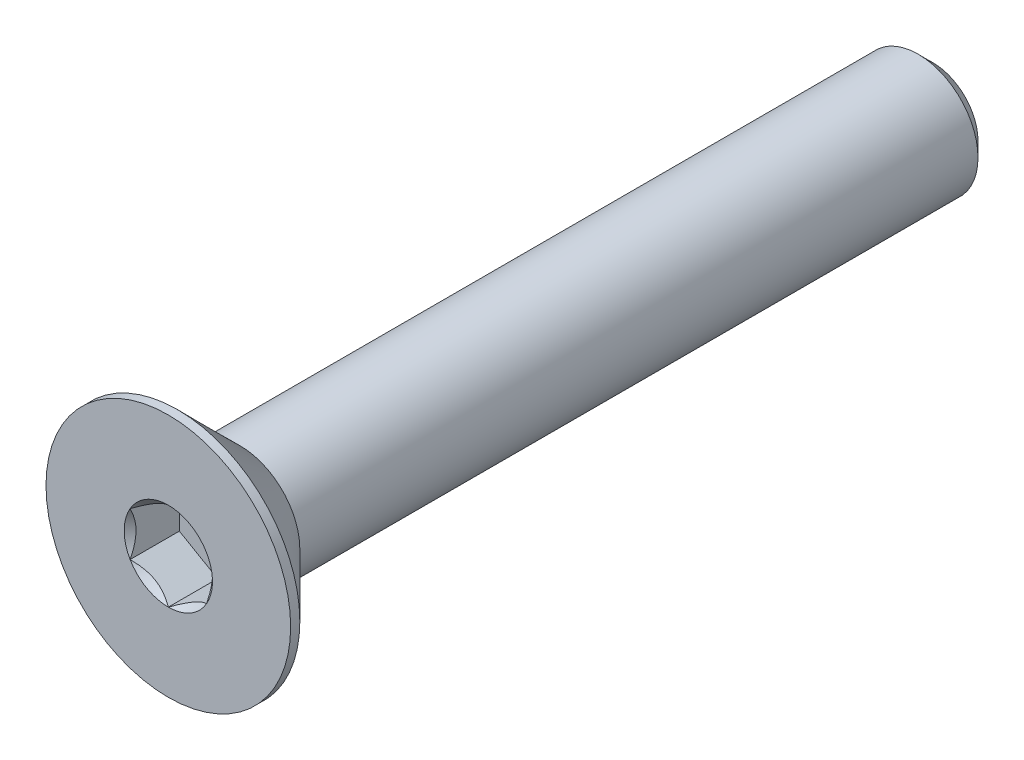
ISO-10303-21;
HEADER;
FILE_DESCRIPTION(('STEP AP214'),'2;1');
FILE_NAME('part.step','',(''),(''),'','','');
FILE_SCHEMA(('AUTOMOTIVE_DESIGN { 1 0 10303 214 1 1 1 1 }'));
ENDSEC;
DATA;
#1=APPLICATION_CONTEXT('core data for automotive mechanical design processes');
#2=APPLICATION_PROTOCOL_DEFINITION('international standard','automotive_design',2000,#1);
#3=PRODUCT_CONTEXT('',#1,'mechanical');
#4=PRODUCT('Part','Part','',(#3));
#5=PRODUCT_RELATED_PRODUCT_CATEGORY('part','',(#4));
#6=PRODUCT_DEFINITION_FORMATION('','',#4);
#7=PRODUCT_DEFINITION_CONTEXT('part definition',#1,'design');
#8=PRODUCT_DEFINITION('design','',#6,#7);
#9=PRODUCT_DEFINITION_SHAPE('','',#8);
#10=(LENGTH_UNIT() NAMED_UNIT(*) SI_UNIT(.MILLI.,.METRE.));
#11=(NAMED_UNIT(*) PLANE_ANGLE_UNIT() SI_UNIT($,.RADIAN.));
#12=(NAMED_UNIT(*) SI_UNIT($,.STERADIAN.) SOLID_ANGLE_UNIT());
#13=UNCERTAINTY_MEASURE_WITH_UNIT(LENGTH_MEASURE(1.E-05),#10,'distance_accuracy_value','');
#14=(GEOMETRIC_REPRESENTATION_CONTEXT(3) GLOBAL_UNCERTAINTY_ASSIGNED_CONTEXT((#13)) GLOBAL_UNIT_ASSIGNED_CONTEXT((#10,
#11,#12)) REPRESENTATION_CONTEXT('',''));
#15=CARTESIAN_POINT('',(0.,0.,0.));
#16=DIRECTION('',(0.,0.,1.));
#17=DIRECTION('',(1.,0.,0.));
#18=AXIS2_PLACEMENT_3D('',#15,#16,#17);
#19=CARTESIAN_POINT('',(1.25,-0.721687836487033,-1.61));
#20=DIRECTION('',(0.,0.,1.));
#21=DIRECTION('',(1.,0.,0.));
#22=AXIS2_PLACEMENT_3D('',#19,#20,#21);
#23=PLANE('',#22);
#24=DIRECTION('',(0.,-1.,0.));
#25=VECTOR('',#24,1.);
#26=CARTESIAN_POINT('',(-1.25,0.721687836487033,-1.61));
#27=LINE('',#26,#25);
#28=CARTESIAN_POINT('',(-1.25,0.721687836487032,-1.61));
#29=VERTEX_POINT('',#28);
#30=CARTESIAN_POINT('',(-1.25,-0.721687836487033,-1.61));
#31=VERTEX_POINT('',#30);
#32=EDGE_CURVE('E83',#29,#31,#27,.T.);
#33=ORIENTED_EDGE('',*,*,#32,.T.);
#34=DIRECTION('',(0.866025403784439,-0.5,0.));
#35=VECTOR('',#34,1.);
#36=CARTESIAN_POINT('',(-1.25,-0.721687836487033,-1.61));
#37=LINE('',#36,#35);
#38=CARTESIAN_POINT('',(0.,-1.44337567297406,-1.61));
#39=VERTEX_POINT('',#38);
#40=EDGE_CURVE('E85',#31,#39,#37,.T.);
#41=ORIENTED_EDGE('',*,*,#40,.T.);
#42=DIRECTION('',(0.866025403784439,0.5,0.));
#43=VECTOR('',#42,1.);
#44=CARTESIAN_POINT('',(0.,-1.44337567297406,-1.61));
#45=LINE('',#44,#43);
#46=CARTESIAN_POINT('',(1.25,-0.721687836487033,-1.61));
#47=VERTEX_POINT('',#46);
#48=EDGE_CURVE('E86',#39,#47,#45,.T.);
#49=ORIENTED_EDGE('',*,*,#48,.T.);
#50=DIRECTION('',(0.,1.,0.));
#51=VECTOR('',#50,1.);
#52=CARTESIAN_POINT('',(1.25,-0.721687836487033,-1.61));
#53=LINE('',#52,#51);
#54=CARTESIAN_POINT('',(1.25,0.721687836487033,-1.61));
#55=VERTEX_POINT('',#54);
#56=EDGE_CURVE('E72',#47,#55,#53,.T.);
#57=ORIENTED_EDGE('',*,*,#56,.T.);
#58=DIRECTION('',(-0.866025403784439,0.5,0.));
#59=VECTOR('',#58,1.);
#60=CARTESIAN_POINT('',(1.25,0.721687836487033,-1.61));
#61=LINE('',#60,#59);
#62=CARTESIAN_POINT('',(0.,1.44337567297406,-1.61));
#63=VERTEX_POINT('',#62);
#64=EDGE_CURVE('E111',#55,#63,#61,.T.);
#65=ORIENTED_EDGE('',*,*,#64,.T.);
#66=DIRECTION('',(-0.866025403784439,-0.5,0.));
#67=VECTOR('',#66,1.);
#68=CARTESIAN_POINT('',(0.,1.44337567297406,-1.61));
#69=LINE('',#68,#67);
#70=EDGE_CURVE('E116',#63,#29,#69,.T.);
#71=ORIENTED_EDGE('',*,*,#70,.T.);
#72=EDGE_LOOP('',(#33,#41,#49,#57,#65,#71));
#73=FACE_BOUND('',#72,.T.);
#74=ADVANCED_FACE('F17',(#73),#23,.T.);
#75=CARTESIAN_POINT('',(0.,-1.44337567297406,-1.61));
#76=DIRECTION('',(0.5,-0.866025403784439,0.));
#77=DIRECTION('',(0.866025403784439,0.5,0.));
#78=AXIS2_PLACEMENT_3D('',#75,#76,#77);
#79=PLANE('',#78);
#80=CARTESIAN_POINT('',(-1.59647601274641E-12,-1.44337567297499,-2.2682928164299E-12));
#81=CARTESIAN_POINT('',(0.0429631084916683,-1.41857091072118,-0.024780960285326));
#82=CARTESIAN_POINT('',(0.0866445640224961,-1.39335141061186,-0.0481062505422108));
#83=CARTESIAN_POINT('',(0.175715534518587,-1.34192626181896,-0.0908138610995846));
#84=CARTESIAN_POINT('',(0.221113515509129,-1.3157157252734,-0.110172426663462));
#85=CARTESIAN_POINT('',(0.312656311401012,-1.26286346742285,-0.143333784117164));
#86=CARTESIAN_POINT('',(0.358777825771211,-1.23623519868579,-0.15721990325138));
#87=CARTESIAN_POINT('',(0.45203596100152,-1.18239258920645,-0.178614098245694));
#88=CARTESIAN_POINT('',(0.499169734949581,-1.15517989212961,-0.186138138130082));
#89=CARTESIAN_POINT('',(0.580409086338886,-1.1082763307362,-0.192927172266352));
#90=CARTESIAN_POINT('',(0.6144098218632,-1.0886459969286,-0.19393181141306));
#91=CARTESIAN_POINT('',(0.682351445146423,-1.04941988243685,-0.192236504858619));
#92=CARTESIAN_POINT('',(0.716292318027036,-1.02982411034269,-0.189535740825175));
#93=CARTESIAN_POINT('',(0.783846380048844,-0.99082175444955,-0.180585751756811));
#94=CARTESIAN_POINT('',(0.817459234875116,-0.97141536366737,-0.174333227052609));
#95=CARTESIAN_POINT('',(0.884123738991267,-0.932926594270518,-0.158616460881214));
#96=CARTESIAN_POINT('',(0.917175141068938,-0.91384435838388,-0.149150841277128));
#97=CARTESIAN_POINT('',(1.00178642984031,-0.864994008035247,-0.121071668556236));
#98=CARTESIAN_POINT('',(1.05281387539248,-0.835533298609642,-0.100350655055702));
#99=CARTESIAN_POINT('',(1.15287239429478,-0.777764485786684,-0.0536764942537952));
#100=CARTESIAN_POINT('',(1.20190935742265,-0.749452981924566,-0.0277403788128117));
#101=CARTESIAN_POINT('',(1.25000000000159,-0.721687836486111,-2.26875042830836E-12));
#102=B_SPLINE_CURVE_WITH_KNOTS('',3,(#80,#81,#82,#83,#84,#85,#86,#87,#88,#89,#90,#91,#92,#93,
#94,#95,#96,#97,#98,#99,#100,#101),.UNSPECIFIED.,.F.,.F.,(4,2,2,2,2,2,2,2,2,2,4),(0.,
0.166478683193945,0.333926926769032,0.498716658424014,0.663091654503518,0.780745575390527,
0.89842548413854,1.01621489951224,1.13405490022132,1.3211159162831,1.5075756576265),.UNSPECIFIED.);
#103=CARTESIAN_POINT('',(0.,-1.44337567297566,-1.59483068508603E-12));
#104=VERTEX_POINT('',#103);
#105=CARTESIAN_POINT('',(1.2500000000008,-0.721687836489763,-1.13439250920524E-12));
#106=VERTEX_POINT('',#105);
#107=EDGE_CURVE('E20',#104,#106,#102,.T.);
#108=ORIENTED_EDGE('',*,*,#107,.T.);
#109=DIRECTION('',(0.,0.,-1.));
#110=VECTOR('',#109,1.);
#111=CARTESIAN_POINT('',(1.25,-0.721687836487033,-1.61));
#112=LINE('',#111,#110);
#113=EDGE_CURVE('E91',#106,#47,#112,.T.);
#114=ORIENTED_EDGE('',*,*,#113,.T.);
#115=ORIENTED_EDGE('',*,*,#48,.F.);
#116=DIRECTION('',(0.,0.,1.));
#117=VECTOR('',#116,1.);
#118=CARTESIAN_POINT('',(0.,-1.44337567297406,-1.61));
#119=LINE('',#118,#117);
#120=EDGE_CURVE('E59',#39,#104,#119,.T.);
#121=ORIENTED_EDGE('',*,*,#120,.T.);
#122=EDGE_LOOP('',(#108,#114,#115,#121));
#123=FACE_BOUND('',#122,.T.);
#124=ADVANCED_FACE('F90',(#123),#79,.F.);
#125=CARTESIAN_POINT('',(-1.25,-0.721687836487033,-1.61));
#126=DIRECTION('',(-0.5,-0.866025403784439,0.));
#127=DIRECTION('',(0.866025403784439,-0.5,0.));
#128=AXIS2_PLACEMENT_3D('',#125,#126,#127);
#129=PLANE('',#128);
#130=CARTESIAN_POINT('',(-1.2500000000016,-0.721687836486111,-2.26822165201017E-12));
#131=CARTESIAN_POINT('',(-1.20703689150833,-0.746492598739921,-0.0247809602853258));
#132=CARTESIAN_POINT('',(-1.1633554359775,-0.771712098849239,-0.0481062505422107));
#133=CARTESIAN_POINT('',(-1.07428446548141,-0.823137247642138,-0.0908138610995846));
#134=CARTESIAN_POINT('',(-1.02888648449087,-0.849347784187693,-0.110172426663462));
#135=CARTESIAN_POINT('',(-0.937343688598987,-0.902200042038243,-0.143333784117164));
#136=CARTESIAN_POINT('',(-0.891222174228788,-0.92882831077531,-0.15721990325138));
#137=CARTESIAN_POINT('',(-0.79796403899848,-0.982670920254651,-0.178614098245694));
#138=CARTESIAN_POINT('',(-0.750830265050418,-1.00988361733149,-0.186138138130082));
#139=CARTESIAN_POINT('',(-0.669590913661113,-1.05678717872489,-0.192927172266351));
#140=CARTESIAN_POINT('',(-0.635590178136799,-1.0764175125325,-0.19393181141306));
#141=CARTESIAN_POINT('',(-0.567648554853576,-1.11564362702425,-0.192236504858619));
#142=CARTESIAN_POINT('',(-0.533707681972964,-1.1352393991184,-0.189535740825174));
#143=CARTESIAN_POINT('',(-0.466153619951155,-1.17424175501155,-0.180585751756811));
#144=CARTESIAN_POINT('',(-0.432540765124883,-1.19364814579373,-0.174333227052609));
#145=CARTESIAN_POINT('',(-0.365876261008733,-1.23213691519058,-0.158616460881213));
#146=CARTESIAN_POINT('',(-0.332824858931062,-1.25121915107722,-0.149150841277128));
#147=CARTESIAN_POINT('',(-0.24821357015969,-1.30006950142585,-0.121071668556235));
#148=CARTESIAN_POINT('',(-0.197186124607517,-1.32953021085146,-0.100350655055701));
#149=CARTESIAN_POINT('',(-0.0971276057052174,-1.38729902367441,-0.0536764942537947));
#150=CARTESIAN_POINT('',(-0.0480906425773461,-1.41561052753653,-0.0277403788128112));
#151=CARTESIAN_POINT('',(1.59603639324309E-12,-1.44337567297499,-2.26819592780585E-12));
#152=B_SPLINE_CURVE_WITH_KNOTS('',3,(#130,#131,#132,#133,#134,#135,#136,#137,#138,#139,#140,
#141,#142,#143,#144,#145,#146,#147,#148,#149,#150,#151),.UNSPECIFIED.,.F.,.F.,(4,2,2,2,2,2,2,2,
2,2,4),(0.,0.166478683193946,0.333926926769032,0.498716658424013,0.663091654503517,
0.780745575390527,0.89842548413854,1.01621489951224,1.13405490022132,1.3211159162831,
1.5075756576265),.UNSPECIFIED.);
#153=CARTESIAN_POINT('',(-1.25000000000138,-0.721687836487831,-1.59402378566955E-12));
#154=VERTEX_POINT('',#153);
#155=EDGE_CURVE('E95',#154,#104,#152,.T.);
#156=ORIENTED_EDGE('',*,*,#155,.T.);
#157=ORIENTED_EDGE('',*,*,#120,.F.);
#158=ORIENTED_EDGE('',*,*,#40,.F.);
#159=DIRECTION('',(0.,0.,1.));
#160=VECTOR('',#159,1.);
#161=CARTESIAN_POINT('',(-1.25,-0.721687836487033,-1.61));
#162=LINE('',#161,#160);
#163=EDGE_CURVE('E97',#31,#154,#162,.T.);
#164=ORIENTED_EDGE('',*,*,#163,.T.);
#165=EDGE_LOOP('',(#156,#157,#158,#164));
#166=FACE_BOUND('',#165,.T.);
#167=ADVANCED_FACE('F93',(#166),#129,.F.);
#168=CARTESIAN_POINT('',(-1.25,0.721687836487033,-1.61));
#169=DIRECTION('',(-1.,0.,0.));
#170=DIRECTION('',(0.,-1.,0.));
#171=AXIS2_PLACEMENT_3D('',#168,#169,#170);
#172=PLANE('',#171);
#173=CARTESIAN_POINT('',(-1.25,0.721687836488875,-2.26706696085874E-12));
#174=CARTESIAN_POINT('',(-1.25,0.672078311968734,-0.0247809602843515));
#175=CARTESIAN_POINT('',(-1.25,0.621639311737501,-0.0481062505397474));
#176=CARTESIAN_POINT('',(-1.25,0.518789014126518,-0.0908138610927559));
#177=CARTESIAN_POINT('',(-1.25,0.466367941022824,-0.110172426653753));
#178=CARTESIAN_POINT('',(-1.25,0.360663425297222,-0.143333784099995));
#179=CARTESIAN_POINT('',(-1.25,0.307406887811172,-0.157219903229681));
#180=CARTESIAN_POINT('',(-1.25,0.199721668829271,-0.178614098213361));
#181=CARTESIAN_POINT('',(-1.25,0.145296274664291,-0.186138138091645));
#182=CARTESIAN_POINT('',(-1.25,0.0514891518512712,-0.192927172217058));
#183=CARTESIAN_POINT('',(-1.25,0.0122284842208853,-0.19393181135857));
#184=CARTESIAN_POINT('',(-1.25,-0.0662237447923836,-0.19223650479206));
#185=CARTESIAN_POINT('',(-1.25,-0.10541528899529,-0.189535740751741));
#186=CARTESIAN_POINT('',(-1.25,-0.183420000810115,-0.180585751668415));
#187=CARTESIAN_POINT('',(-1.25,-0.222232782388411,-0.174333226956124));
#188=CARTESIAN_POINT('',(-1.25,-0.29921032120936,-0.158616460767832));
#189=CARTESIAN_POINT('',(-1.25,-0.337374792995946,-0.14915084115494));
#190=CARTESIAN_POINT('',(-1.25,-0.435075493649191,-0.121071668433227));
#191=CARTESIAN_POINT('',(-1.25,-0.493996912445359,-0.100350654949516));
#192=CARTESIAN_POINT('',(-1.25,-0.609534537985814,-0.0536764941931677));
#193=CARTESIAN_POINT('',(-1.25,-0.666157545659632,-0.0277403787809129));
#194=CARTESIAN_POINT('',(-1.25,-0.721687836488875,-2.26700895969869E-12));
#195=B_SPLINE_CURVE_WITH_KNOTS('',3,(#173,#174,#175,#176,#177,#178,#179,#180,#181,#182,#183,
#184,#185,#186,#187,#188,#189,#190,#191,#192,#193,#194),.UNSPECIFIED.,.F.,.F.,(4,2,2,2,2,2,2,2,
2,2,4),(0.,0.166478683226287,0.333926926833723,0.498716658519756,0.663091654630285,
0.780745575562284,0.89842548435534,1.01621489977414,1.13405490052833,1.3211159164188,
1.50757565759031),.UNSPECIFIED.);
#196=CARTESIAN_POINT('',(-1.25000000000138,0.721687836487829,-1.5946106273097E-12));
#197=VERTEX_POINT('',#196);
#198=EDGE_CURVE('E195',#197,#154,#195,.T.);
#199=ORIENTED_EDGE('',*,*,#198,.T.);
#200=ORIENTED_EDGE('',*,*,#163,.F.);
#201=ORIENTED_EDGE('',*,*,#32,.F.);
#202=DIRECTION('',(0.,0.,1.));
#203=VECTOR('',#202,1.);
#204=CARTESIAN_POINT('',(-1.25,0.721687836487031,-1.61));
#205=LINE('',#204,#203);
#206=EDGE_CURVE('E113',#29,#197,#205,.T.);
#207=ORIENTED_EDGE('',*,*,#206,.T.);
#208=EDGE_LOOP('',(#199,#200,#201,#207));
#209=FACE_BOUND('',#208,.T.);
#210=ADVANCED_FACE('F205',(#209),#172,.F.);
#211=CARTESIAN_POINT('',(0.,1.44337567297406,-1.61));
#212=DIRECTION('',(-0.5,0.866025403784439,0.));
#213=DIRECTION('',(-0.866025403784439,-0.5,0.));
#214=AXIS2_PLACEMENT_3D('',#211,#212,#213);
#215=PLANE('',#214);
#216=CARTESIAN_POINT('',(1.59665862978069E-12,1.44337567297499,-2.26830488775659E-12));
#217=CARTESIAN_POINT('',(-0.0429631084916682,1.41857091072118,-0.024780960285326));
#218=CARTESIAN_POINT('',(-0.086644564022496,1.39335141061186,-0.0481062505422109));
#219=CARTESIAN_POINT('',(-0.175715534518587,1.34192626181896,-0.0908138610995848));
#220=CARTESIAN_POINT('',(-0.221113515509129,1.3157157252734,-0.110172426663462));
#221=CARTESIAN_POINT('',(-0.312656311401012,1.26286346742285,-0.143333784117164));
#222=CARTESIAN_POINT('',(-0.358777825771211,1.23623519868579,-0.15721990325138));
#223=CARTESIAN_POINT('',(-0.45203596100152,1.18239258920645,-0.178614098245694));
#224=CARTESIAN_POINT('',(-0.499169734949581,1.15517989212961,-0.186138138130082));
#225=CARTESIAN_POINT('',(-0.580409086338886,1.1082763307362,-0.192927172266352));
#226=CARTESIAN_POINT('',(-0.6144098218632,1.0886459969286,-0.19393181141306));
#227=CARTESIAN_POINT('',(-0.682351445146423,1.04941988243685,-0.192236504858619));
#228=CARTESIAN_POINT('',(-0.716292318027036,1.02982411034269,-0.189535740825175));
#229=CARTESIAN_POINT('',(-0.783846380048844,0.99082175444955,-0.180585751756811));
#230=CARTESIAN_POINT('',(-0.817459234875116,0.97141536366737,-0.174333227052609));
#231=CARTESIAN_POINT('',(-0.884123738991267,0.932926594270518,-0.158616460881214));
#232=CARTESIAN_POINT('',(-0.917175141068938,0.91384435838388,-0.149150841277128));
#233=CARTESIAN_POINT('',(-1.00178642984031,0.864994008035247,-0.121071668556235));
#234=CARTESIAN_POINT('',(-1.05281387539248,0.835533298609641,-0.100350655055702));
#235=CARTESIAN_POINT('',(-1.15287239429478,0.777764485786683,-0.0536764942537948));
#236=CARTESIAN_POINT('',(-1.20190935742265,0.749452981924565,-0.0277403788128113));
#237=CARTESIAN_POINT('',(-1.2500000000016,0.72168783648611,-2.26809894531069E-12));
#238=B_SPLINE_CURVE_WITH_KNOTS('',3,(#216,#217,#218,#219,#220,#221,#222,#223,#224,#225,#226,
#227,#228,#229,#230,#231,#232,#233,#234,#235,#236,#237),.UNSPECIFIED.,.F.,.F.,(4,2,2,2,2,2,2,2,
2,2,4),(0.,0.166478683193946,0.333926926769032,0.498716658424014,0.663091654503518,
0.780745575390527,0.898425484138541,1.01621489951224,1.13405490022132,1.3211159162831,
1.5075756576265),.UNSPECIFIED.);
#239=CARTESIAN_POINT('',(0.,1.44337567297566,-1.59483068508603E-12));
#240=VERTEX_POINT('',#239);
#241=EDGE_CURVE('E187',#240,#197,#238,.T.);
#242=ORIENTED_EDGE('',*,*,#241,.T.);
#243=ORIENTED_EDGE('',*,*,#206,.F.);
#244=ORIENTED_EDGE('',*,*,#70,.F.);
#245=DIRECTION('',(0.,0.,1.));
#246=VECTOR('',#245,1.);
#247=CARTESIAN_POINT('',(0.,1.44337567297406,-1.61));
#248=LINE('',#247,#246);
#249=EDGE_CURVE('E108',#63,#240,#248,.T.);
#250=ORIENTED_EDGE('',*,*,#249,.T.);
#251=EDGE_LOOP('',(#242,#243,#244,#250));
#252=FACE_BOUND('',#251,.T.);
#253=ADVANCED_FACE('F201',(#252),#215,.F.);
#254=CARTESIAN_POINT('',(1.25,0.721687836487033,-1.61));
#255=DIRECTION('',(0.5,0.866025403784439,0.));
#256=DIRECTION('',(-0.866025403784439,0.5,0.));
#257=AXIS2_PLACEMENT_3D('',#254,#255,#256);
#258=PLANE('',#257);
#259=CARTESIAN_POINT('',(1.2500000000016,0.721687836486112,-2.26853683468408E-12));
#260=CARTESIAN_POINT('',(1.20703689150833,0.746492598739921,-0.0247809602853261));
#261=CARTESIAN_POINT('',(1.1633554359775,0.771712098849239,-0.0481062505422109));
#262=CARTESIAN_POINT('',(1.07428446548141,0.823137247642138,-0.0908138610995848));
#263=CARTESIAN_POINT('',(1.02888648449087,0.849347784187694,-0.110172426663462));
#264=CARTESIAN_POINT('',(0.937343688598987,0.902200042038243,-0.143333784117164));
#265=CARTESIAN_POINT('',(0.891222174228788,0.92882831077531,-0.15721990325138));
#266=CARTESIAN_POINT('',(0.79796403899848,0.982670920254651,-0.178614098245694));
#267=CARTESIAN_POINT('',(0.750830265050418,1.00988361733149,-0.186138138130081));
#268=CARTESIAN_POINT('',(0.669590913661114,1.05678717872489,-0.192927172266351));
#269=CARTESIAN_POINT('',(0.6355901781368,1.0764175125325,-0.19393181141306));
#270=CARTESIAN_POINT('',(0.567648554853577,1.11564362702425,-0.192236504858619));
#271=CARTESIAN_POINT('',(0.533707681972964,1.1352393991184,-0.189535740825175));
#272=CARTESIAN_POINT('',(0.466153619951156,1.17424175501155,-0.180585751756811));
#273=CARTESIAN_POINT('',(0.432540765124884,1.19364814579373,-0.174333227052609));
#274=CARTESIAN_POINT('',(0.365876261008733,1.23213691519058,-0.158616460881213));
#275=CARTESIAN_POINT('',(0.332824858931062,1.25121915107722,-0.149150841277128));
#276=CARTESIAN_POINT('',(0.24821357015969,1.30006950142585,-0.121071668556235));
#277=CARTESIAN_POINT('',(0.197186124607517,1.32953021085146,-0.100350655055702));
#278=CARTESIAN_POINT('',(0.0971276057052176,1.38729902367441,-0.0536764942537948));
#279=CARTESIAN_POINT('',(0.0480906425773463,1.41561052753653,-0.0277403788128113));
#280=CARTESIAN_POINT('',(-1.59576689606698E-12,1.44337567297499,-2.26849473842903E-12));
#281=B_SPLINE_CURVE_WITH_KNOTS('',3,(#259,#260,#261,#262,#263,#264,#265,#266,#267,#268,#269,
#270,#271,#272,#273,#274,#275,#276,#277,#278,#279,#280),.UNSPECIFIED.,.F.,.F.,(4,2,2,2,2,2,2,2,
2,2,4),(0.,0.166478683193945,0.333926926769032,0.498716658424013,0.663091654503516,
0.780745575390525,0.898425484138539,1.01621489951224,1.13405490022132,1.32111591628309,
1.5075756576265),.UNSPECIFIED.);
#282=CARTESIAN_POINT('',(1.25000000000138,0.721687836487831,-1.5951241137448E-12));
#283=VERTEX_POINT('',#282);
#284=EDGE_CURVE('E157',#283,#240,#281,.T.);
#285=ORIENTED_EDGE('',*,*,#284,.T.);
#286=ORIENTED_EDGE('',*,*,#249,.F.);
#287=ORIENTED_EDGE('',*,*,#64,.F.);
#288=DIRECTION('',(0.,0.,-1.));
#289=VECTOR('',#288,1.);
#290=CARTESIAN_POINT('',(1.25,0.721687836487033,-1.61));
#291=LINE('',#290,#289);
#292=EDGE_CURVE('E40',#55,#283,#291,.F.);
#293=ORIENTED_EDGE('',*,*,#292,.T.);
#294=EDGE_LOOP('',(#285,#286,#287,#293));
#295=FACE_BOUND('',#294,.T.);
#296=ADVANCED_FACE('F204',(#295),#258,.F.);
#297=CARTESIAN_POINT('',(1.25,-0.721687836487033,-1.61));
#298=DIRECTION('',(1.,0.,0.));
#299=DIRECTION('',(0.,0.,-1.));
#300=AXIS2_PLACEMENT_3D('',#297,#298,#299);
#301=PLANE('',#300);
#302=CARTESIAN_POINT('',(1.25,-0.721687836488877,-2.26868308493624E-12));
#303=CARTESIAN_POINT('',(1.25,-0.672078311968736,-0.0247809602843533));
#304=CARTESIAN_POINT('',(1.25,-0.621639311737502,-0.0481062505397492));
#305=CARTESIAN_POINT('',(1.25,-0.51878901412652,-0.0908138610927579));
#306=CARTESIAN_POINT('',(1.25,-0.466367941022825,-0.110172426653756));
#307=CARTESIAN_POINT('',(1.25,-0.360663425297223,-0.143333784099998));
#308=CARTESIAN_POINT('',(1.25,-0.307406887811173,-0.157219903229684));
#309=CARTESIAN_POINT('',(1.25,-0.199721668829271,-0.178614098213363));
#310=CARTESIAN_POINT('',(1.25,-0.145296274664292,-0.186138138091648));
#311=CARTESIAN_POINT('',(1.25,-0.051489151851272,-0.19292717221706));
#312=CARTESIAN_POINT('',(1.25,-0.0122284842208861,-0.193931811358573));
#313=CARTESIAN_POINT('',(1.25,0.0662237447923826,-0.192236504792063));
#314=CARTESIAN_POINT('',(1.25,0.105415288995289,-0.189535740751744));
#315=CARTESIAN_POINT('',(1.25,0.183420000810113,-0.180585751668418));
#316=CARTESIAN_POINT('',(1.25,0.222232782388409,-0.174333226956127));
#317=CARTESIAN_POINT('',(1.25,0.299210321209359,-0.158616460767835));
#318=CARTESIAN_POINT('',(1.25,0.337374792995944,-0.149150841154943));
#319=CARTESIAN_POINT('',(1.25,0.435075493649189,-0.12107166843323));
#320=CARTESIAN_POINT('',(1.25,0.493996912445358,-0.100350654949519));
#321=CARTESIAN_POINT('',(1.25,0.609534537985814,-0.05367649419317));
#322=CARTESIAN_POINT('',(1.25,0.666157545659632,-0.0277403787809149));
#323=CARTESIAN_POINT('',(1.25,0.721687836488876,-2.26874528890848E-12));
#324=B_SPLINE_CURVE_WITH_KNOTS('',3,(#302,#303,#304,#305,#306,#307,#308,#309,#310,#311,#312,
#313,#314,#315,#316,#317,#318,#319,#320,#321,#322,#323),.UNSPECIFIED.,.F.,.F.,(4,2,2,2,2,2,2,2,
2,2,4),(0.,0.166478683226287,0.333926926833724,0.498716658519757,0.663091654630287,
0.780745575562285,0.898425484355341,1.01621489977414,1.13405490052833,1.3211159164188,
1.50757565759032),.UNSPECIFIED.);
#325=EDGE_CURVE('E149',#106,#283,#324,.T.);
#326=ORIENTED_EDGE('',*,*,#325,.T.);
#327=ORIENTED_EDGE('',*,*,#292,.F.);
#328=ORIENTED_EDGE('',*,*,#56,.F.);
#329=ORIENTED_EDGE('',*,*,#113,.F.);
#330=EDGE_LOOP('',(#326,#327,#328,#329));
#331=FACE_BOUND('',#330,.T.);
#332=ADVANCED_FACE('F165',(#331),#301,.F.);
#333=CARTESIAN_POINT('',(0.,0.,-5.6843418860808E-11));
#334=DIRECTION('',(0.,0.,1.));
#335=DIRECTION('',(1.,0.,0.));
#336=AXIS2_PLACEMENT_3D('',#333,#334,#335);
#337=CONICAL_SURFACE('',#336,1.44337567292041,0.78539816325135);
#338=ORIENTED_EDGE('',*,*,#107,.F.);
#339=CARTESIAN_POINT('',(0.,0.,0.));
#340=DIRECTION('',(0.,0.,1.));
#341=DIRECTION('',(1.,0.,0.));
#342=AXIS2_PLACEMENT_3D('',#339,#340,#341);
#343=CIRCLE('',#342,1.44337567297725);
#344=EDGE_CURVE('E146',#106,#104,#343,.F.);
#345=ORIENTED_EDGE('',*,*,#344,.F.);
#346=EDGE_LOOP('',(#338,#345));
#347=FACE_BOUND('',#346,.T.);
#348=ADVANCED_FACE('F222',(#347),#337,.F.);
#349=CARTESIAN_POINT('',(0.,0.,-5.6843418860808E-11));
#350=DIRECTION('',(0.,0.,1.));
#351=DIRECTION('',(1.,0.,0.));
#352=AXIS2_PLACEMENT_3D('',#349,#350,#351);
#353=CONICAL_SURFACE('',#352,1.44337567292041,0.78539816325135);
#354=ORIENTED_EDGE('',*,*,#155,.F.);
#355=CARTESIAN_POINT('',(0.,0.,0.));
#356=DIRECTION('',(0.,0.,1.));
#357=DIRECTION('',(1.,0.,0.));
#358=AXIS2_PLACEMENT_3D('',#355,#356,#357);
#359=CIRCLE('',#358,1.44337567297725);
#360=EDGE_CURVE('E143',#104,#154,#359,.F.);
#361=ORIENTED_EDGE('',*,*,#360,.F.);
#362=EDGE_LOOP('',(#354,#361));
#363=FACE_BOUND('',#362,.T.);
#364=ADVANCED_FACE('F219',(#363),#353,.F.);
#365=CARTESIAN_POINT('',(0.,0.,-5.6843418860808E-11));
#366=DIRECTION('',(0.,0.,1.));
#367=DIRECTION('',(1.,0.,0.));
#368=AXIS2_PLACEMENT_3D('',#365,#366,#367);
#369=CONICAL_SURFACE('',#368,1.44337567292041,0.785398163397448);
#370=ORIENTED_EDGE('',*,*,#198,.F.);
#371=CARTESIAN_POINT('',(0.,0.,0.));
#372=DIRECTION('',(0.,0.,1.));
#373=DIRECTION('',(1.,0.,0.));
#374=AXIS2_PLACEMENT_3D('',#371,#372,#373);
#375=CIRCLE('',#374,1.44337567297725);
#376=EDGE_CURVE('E140',#154,#197,#375,.F.);
#377=ORIENTED_EDGE('',*,*,#376,.F.);
#378=EDGE_LOOP('',(#370,#377));
#379=FACE_BOUND('',#378,.T.);
#380=ADVANCED_FACE('F183',(#379),#369,.F.);
#381=CARTESIAN_POINT('',(0.,0.,-5.6843418860808E-11));
#382=DIRECTION('',(0.,0.,1.));
#383=DIRECTION('',(1.,0.,0.));
#384=AXIS2_PLACEMENT_3D('',#381,#382,#383);
#385=CONICAL_SURFACE('',#384,1.44337567292041,0.78539816325135);
#386=ORIENTED_EDGE('',*,*,#241,.F.);
#387=CARTESIAN_POINT('',(0.,0.,0.));
#388=DIRECTION('',(0.,0.,1.));
#389=DIRECTION('',(1.,0.,0.));
#390=AXIS2_PLACEMENT_3D('',#387,#388,#389);
#391=CIRCLE('',#390,1.44337567297725);
#392=EDGE_CURVE('E137',#197,#240,#391,.F.);
#393=ORIENTED_EDGE('',*,*,#392,.F.);
#394=EDGE_LOOP('',(#386,#393));
#395=FACE_BOUND('',#394,.T.);
#396=ADVANCED_FACE('F178',(#395),#385,.F.);
#397=CARTESIAN_POINT('',(0.,0.,-5.6843418860808E-11));
#398=DIRECTION('',(0.,0.,1.));
#399=DIRECTION('',(1.,0.,0.));
#400=AXIS2_PLACEMENT_3D('',#397,#398,#399);
#401=CONICAL_SURFACE('',#400,1.44337567292041,0.78539816325135);
#402=ORIENTED_EDGE('',*,*,#284,.F.);
#403=CARTESIAN_POINT('',(0.,0.,0.));
#404=DIRECTION('',(0.,0.,1.));
#405=DIRECTION('',(1.,0.,0.));
#406=AXIS2_PLACEMENT_3D('',#403,#404,#405);
#407=CIRCLE('',#406,1.44337567297725);
#408=EDGE_CURVE('E134',#240,#283,#407,.F.);
#409=ORIENTED_EDGE('',*,*,#408,.F.);
#410=EDGE_LOOP('',(#402,#409));
#411=FACE_BOUND('',#410,.T.);
#412=ADVANCED_FACE('F172',(#411),#401,.F.);
#413=CARTESIAN_POINT('',(0.,0.,-5.6843418860808E-11));
#414=DIRECTION('',(0.,0.,1.));
#415=DIRECTION('',(1.,0.,0.));
#416=AXIS2_PLACEMENT_3D('',#413,#414,#415);
#417=CONICAL_SURFACE('',#416,1.44337567292041,0.785398163397448);
#418=CARTESIAN_POINT('',(0.,0.,0.));
#419=DIRECTION('',(0.,0.,1.));
#420=DIRECTION('',(1.,0.,0.));
#421=AXIS2_PLACEMENT_3D('',#418,#419,#420);
#422=CIRCLE('',#421,1.44337567297725);
#423=EDGE_CURVE('E131',#283,#106,#422,.F.);
#424=ORIENTED_EDGE('',*,*,#423,.F.);
#425=ORIENTED_EDGE('',*,*,#325,.F.);
#426=EDGE_LOOP('',(#424,#425));
#427=FACE_BOUND('',#426,.T.);
#428=ADVANCED_FACE('F167',(#427),#417,.F.);
#429=CARTESIAN_POINT('',(0.,-2.,0.));
#430=DIRECTION('',(0.,0.,1.));
#431=DIRECTION('',(0.,-1.,0.));
#432=AXIS2_PLACEMENT_3D('',#429,#430,#431);
#433=PLANE('',#432);
#434=ORIENTED_EDGE('',*,*,#408,.T.);
#435=ORIENTED_EDGE('',*,*,#423,.T.);
#436=ORIENTED_EDGE('',*,*,#344,.T.);
#437=ORIENTED_EDGE('',*,*,#360,.T.);
#438=ORIENTED_EDGE('',*,*,#376,.T.);
#439=ORIENTED_EDGE('',*,*,#392,.T.);
#440=EDGE_LOOP('',(#434,#435,#436,#437,#438,#439));
#441=FACE_BOUND('',#440,.T.);
#442=CARTESIAN_POINT('',(0.,0.,0.));
#443=DIRECTION('',(0.,0.,1.));
#444=DIRECTION('',(0.,-1.,0.));
#445=AXIS2_PLACEMENT_3D('',#442,#443,#444);
#446=CIRCLE('',#445,4.);
#447=CARTESIAN_POINT('',(0.,-4.,0.));
#448=VERTEX_POINT('',#447);
#449=EDGE_CURVE('E128',#448,#448,#446,.F.);
#450=ORIENTED_EDGE('',*,*,#449,.F.);
#451=EDGE_LOOP('',(#450));
#452=FACE_BOUND('',#451,.T.);
#453=ADVANCED_FACE('F171',(#441,#452),#433,.T.);
#454=CARTESIAN_POINT('',(0.,-2.,-25.));
#455=DIRECTION('',(0.,0.,-1.));
#456=DIRECTION('',(0.,1.,0.));
#457=AXIS2_PLACEMENT_3D('',#454,#455,#456);
#458=PLANE('',#457);
#459=CARTESIAN_POINT('',(0.,0.,-25.0000000000341));
#460=DIRECTION('',(0.,0.,1.));
#461=DIRECTION('',(1.,0.,0.));
#462=AXIS2_PLACEMENT_3D('',#459,#460,#461);
#463=CIRCLE('',#462,1.47499999997081);
#464=CARTESIAN_POINT('',(1.47499999997081,0.,-25.0000000000341));
#465=VERTEX_POINT('',#464);
#466=EDGE_CURVE('E124',#465,#465,#463,.T.);
#467=ORIENTED_EDGE('',*,*,#466,.F.);
#468=EDGE_LOOP('',(#467));
#469=FACE_BOUND('',#468,.T.);
#470=ADVANCED_FACE('F250',(#469),#458,.T.);
#471=CARTESIAN_POINT('',(0.,0.,0.));
#472=DIRECTION('',(0.,0.,1.));
#473=DIRECTION('',(0.,-1.,0.));
#474=AXIS2_PLACEMENT_3D('',#471,#472,#473);
#475=CYLINDRICAL_SURFACE('',#474,4.);
#476=CARTESIAN_POINT('',(0.,0.,-0.29999999998154));
#477=DIRECTION('',(0.,0.,1.));
#478=DIRECTION('',(0.,-1.,0.));
#479=AXIS2_PLACEMENT_3D('',#476,#477,#478);
#480=CIRCLE('',#479,4.0000000000191);
#481=CARTESIAN_POINT('',(0.,-4.0000000000191,-0.299999999981537));
#482=VERTEX_POINT('',#481);
#483=EDGE_CURVE('E127',#482,#482,#480,.F.);
#484=ORIENTED_EDGE('',*,*,#483,.F.);
#485=EDGE_LOOP('',(#484));
#486=FACE_BOUND('',#485,.T.);
#487=ORIENTED_EDGE('',*,*,#449,.T.);
#488=EDGE_LOOP('',(#487));
#489=FACE_BOUND('',#488,.T.);
#490=ADVANCED_FACE('F247',(#486,#489),#475,.T.);
#491=CARTESIAN_POINT('',(0.,0.,-24.5209999999361));
#492=DIRECTION('',(0.,0.,1.));
#493=DIRECTION('',(1.,0.,0.));
#494=AXIS2_PLACEMENT_3D('',#491,#492,#493);
#495=CONICAL_SURFACE('',#494,1.954000000012,0.785398163338113);
#496=CARTESIAN_POINT('',(0.,0.,-24.521));
#497=DIRECTION('',(0.,0.,-1.));
#498=DIRECTION('',(0.,1.,0.));
#499=AXIS2_PLACEMENT_3D('',#496,#497,#498);
#500=CIRCLE('',#499,1.954);
#501=CARTESIAN_POINT('',(0.,1.954,-24.521));
#502=VERTEX_POINT('',#501);
#503=EDGE_CURVE('E31',#502,#502,#500,.F.);
#504=ORIENTED_EDGE('',*,*,#503,.F.);
#505=EDGE_LOOP('',(#504));
#506=FACE_BOUND('',#505,.T.);
#507=ORIENTED_EDGE('',*,*,#466,.T.);
#508=EDGE_LOOP('',(#507));
#509=FACE_BOUND('',#508,.T.);
#510=ADVANCED_FACE('F240',(#506,#509),#495,.T.);
#511=CARTESIAN_POINT('',(0.,0.,-0.300000000038384));
#512=DIRECTION('',(0.,0.,1.));
#513=DIRECTION('',(0.,-1.,0.));
#514=AXIS2_PLACEMENT_3D('',#511,#512,#513);
#515=CONICAL_SURFACE('',#514,3.99999999990541,0.785398163397449);
#516=CARTESIAN_POINT('',(0.,0.,-2.346));
#517=DIRECTION('',(0.,0.,-1.));
#518=DIRECTION('',(0.,1.,0.));
#519=AXIS2_PLACEMENT_3D('',#516,#517,#518);
#520=CIRCLE('',#519,1.954);
#521=CARTESIAN_POINT('',(0.,1.954,-2.346));
#522=VERTEX_POINT('',#521);
#523=EDGE_CURVE('E11',#522,#522,#520,.T.);
#524=ORIENTED_EDGE('',*,*,#523,.F.);
#525=EDGE_LOOP('',(#524));
#526=FACE_BOUND('',#525,.T.);
#527=ORIENTED_EDGE('',*,*,#483,.T.);
#528=EDGE_LOOP('',(#527));
#529=FACE_BOUND('',#528,.T.);
#530=ADVANCED_FACE('F234',(#526,#529),#515,.T.);
#531=CARTESIAN_POINT('',(0.,0.,-25.));
#532=DIRECTION('',(0.,0.,-1.));
#533=DIRECTION('',(0.,1.,0.));
#534=AXIS2_PLACEMENT_3D('',#531,#532,#533);
#535=CYLINDRICAL_SURFACE('',#534,1.954);
#536=ORIENTED_EDGE('',*,*,#523,.T.);
#537=EDGE_LOOP('',(#536));
#538=FACE_BOUND('',#537,.T.);
#539=ORIENTED_EDGE('',*,*,#503,.T.);
#540=EDGE_LOOP('',(#539));
#541=FACE_BOUND('',#540,.T.);
#542=ADVANCED_FACE('F232',(#538,#541),#535,.T.);
#543=CLOSED_SHELL('',(#74,#124,#167,#210,#253,#296,#332,#348,#364,#380,#396,#412,#428,#453,#470,
#490,#510,#530,#542));
#544=MANIFOLD_SOLID_BREP('B1',#543);
#545=ADVANCED_BREP_SHAPE_REPRESENTATION('',(#18,#544),#14);
#546=SHAPE_DEFINITION_REPRESENTATION(#9,#545);
ENDSEC;
END-ISO-10303-21;
